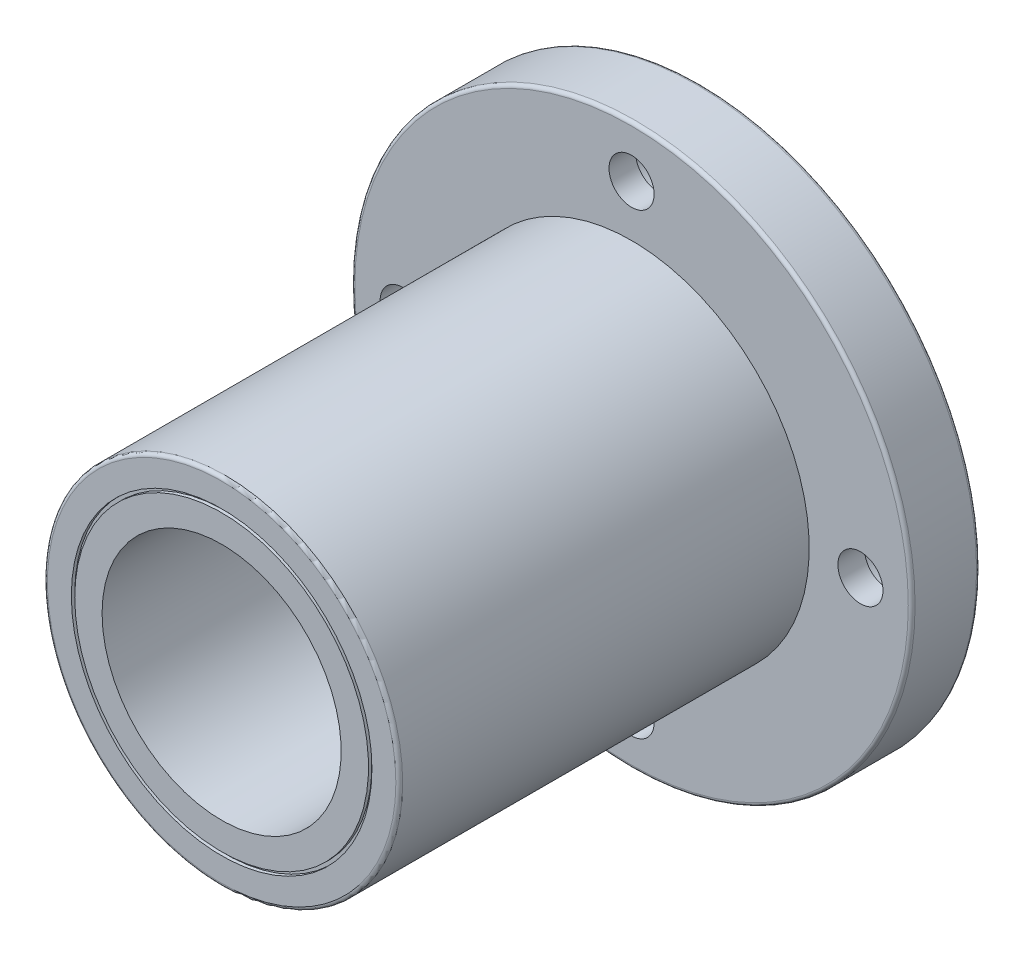
ISO-10303-21;
HEADER;
FILE_DESCRIPTION(('STEP AP214'),'2;1');
FILE_NAME('part.step','',(''),(''),'','','');
FILE_SCHEMA(('AUTOMOTIVE_DESIGN { 1 0 10303 214 1 1 1 1 }'));
ENDSEC;
DATA;
#1=APPLICATION_CONTEXT('core data for automotive mechanical design processes');
#2=APPLICATION_PROTOCOL_DEFINITION('international standard','automotive_design',2000,#1);
#3=PRODUCT_CONTEXT('',#1,'mechanical');
#4=PRODUCT('Part','Part','',(#3));
#5=PRODUCT_RELATED_PRODUCT_CATEGORY('part','',(#4));
#6=PRODUCT_DEFINITION_FORMATION('','',#4);
#7=PRODUCT_DEFINITION_CONTEXT('part definition',#1,'design');
#8=PRODUCT_DEFINITION('design','',#6,#7);
#9=PRODUCT_DEFINITION_SHAPE('','',#8);
#10=(LENGTH_UNIT() NAMED_UNIT(*) SI_UNIT(.MILLI.,.METRE.));
#11=(NAMED_UNIT(*) PLANE_ANGLE_UNIT() SI_UNIT($,.RADIAN.));
#12=(NAMED_UNIT(*) SI_UNIT($,.STERADIAN.) SOLID_ANGLE_UNIT());
#13=UNCERTAINTY_MEASURE_WITH_UNIT(LENGTH_MEASURE(1.E-05),#10,'distance_accuracy_value','');
#14=(GEOMETRIC_REPRESENTATION_CONTEXT(3) GLOBAL_UNCERTAINTY_ASSIGNED_CONTEXT((#13)) GLOBAL_UNIT_ASSIGNED_CONTEXT((#10,
#11,#12)) REPRESENTATION_CONTEXT('',''));
#15=CARTESIAN_POINT('',(0.,0.,0.));
#16=DIRECTION('',(0.,0.,1.));
#17=DIRECTION('',(1.,0.,0.));
#18=AXIS2_PLACEMENT_3D('',#15,#16,#17);
#19=CARTESIAN_POINT('',(0.,26.,0.));
#20=DIRECTION('',(0.,0.,-1.));
#21=DIRECTION('',(-1.,0.,0.));
#22=AXIS2_PLACEMENT_3D('',#19,#20,#21);
#23=PLANE('',#22);
#24=CARTESIAN_POINT('',(0.,0.,0.));
#25=DIRECTION('',(0.,0.,-1.));
#26=DIRECTION('',(-1.,0.,0.));
#27=AXIS2_PLACEMENT_3D('',#24,#25,#26);
#28=CIRCLE('',#27,40.5);
#29=CARTESIAN_POINT('',(-40.5,0.,0.));
#30=VERTEX_POINT('',#29);
#31=EDGE_CURVE('E72',#30,#30,#28,.T.);
#32=ORIENTED_EDGE('',*,*,#31,.T.);
#33=EDGE_LOOP('',(#32));
#34=FACE_BOUND('',#33,.T.);
#35=CARTESIAN_POINT('',(0.,-33.5,0.));
#36=DIRECTION('',(0.,0.,1.));
#37=DIRECTION('',(0.,1.,0.));
#38=AXIS2_PLACEMENT_3D('',#35,#36,#37);
#39=CIRCLE('',#38,5.49999999999999);
#40=CARTESIAN_POINT('',(0.,-28.,0.));
#41=VERTEX_POINT('',#40);
#42=EDGE_CURVE('E166',#41,#41,#39,.T.);
#43=ORIENTED_EDGE('',*,*,#42,.T.);
#44=EDGE_LOOP('',(#43));
#45=FACE_BOUND('',#44,.T.);
#46=CARTESIAN_POINT('',(0.,33.5,0.));
#47=DIRECTION('',(0.,0.,1.));
#48=DIRECTION('',(0.,-1.,0.));
#49=AXIS2_PLACEMENT_3D('',#46,#47,#48);
#50=CIRCLE('',#49,5.49999999999999);
#51=CARTESIAN_POINT('',(0.,28.,0.));
#52=VERTEX_POINT('',#51);
#53=EDGE_CURVE('E135',#52,#52,#50,.T.);
#54=ORIENTED_EDGE('',*,*,#53,.T.);
#55=EDGE_LOOP('',(#54));
#56=FACE_BOUND('',#55,.T.);
#57=CARTESIAN_POINT('',(0.,0.,0.));
#58=DIRECTION('',(0.,0.,-1.));
#59=DIRECTION('',(-1.,0.,0.));
#60=AXIS2_PLACEMENT_3D('',#57,#58,#59);
#61=CIRCLE('',#60,26.);
#62=CARTESIAN_POINT('',(-26.,0.,0.));
#63=VERTEX_POINT('',#62);
#64=EDGE_CURVE('E131',#63,#63,#61,.T.);
#65=ORIENTED_EDGE('',*,*,#64,.F.);
#66=EDGE_LOOP('',(#65));
#67=FACE_BOUND('',#66,.T.);
#68=CARTESIAN_POINT('',(33.5,-1.16964624851245E-13,0.));
#69=DIRECTION('',(0.,0.,1.));
#70=DIRECTION('',(-1.,0.,0.));
#71=AXIS2_PLACEMENT_3D('',#68,#69,#70);
#72=CIRCLE('',#71,5.49999999999999);
#73=CARTESIAN_POINT('',(28.,0.,0.));
#74=VERTEX_POINT('',#73);
#75=EDGE_CURVE('E151',#74,#74,#72,.T.);
#76=ORIENTED_EDGE('',*,*,#75,.T.);
#77=EDGE_LOOP('',(#76));
#78=FACE_BOUND('',#77,.T.);
#79=CARTESIAN_POINT('',(-33.5,3.50893874553735E-13,0.));
#80=DIRECTION('',(0.,0.,1.));
#81=DIRECTION('',(1.,0.,0.));
#82=AXIS2_PLACEMENT_3D('',#79,#80,#81);
#83=CIRCLE('',#82,5.49999999999999);
#84=CARTESIAN_POINT('',(-28.,2.93284432462823E-13,0.));
#85=VERTEX_POINT('',#84);
#86=EDGE_CURVE('E181',#85,#85,#83,.T.);
#87=ORIENTED_EDGE('',*,*,#86,.T.);
#88=EDGE_LOOP('',(#87));
#89=FACE_BOUND('',#88,.T.);
#90=ADVANCED_FACE('F40',(#34,#45,#56,#67,#78,#89),#23,.T.);
#91=CARTESIAN_POINT('',(0.,41.,10.));
#92=DIRECTION('',(0.,0.,1.));
#93=DIRECTION('',(1.,0.,0.));
#94=AXIS2_PLACEMENT_3D('',#91,#92,#93);
#95=PLANE('',#94);
#96=CARTESIAN_POINT('',(0.,0.,10.));
#97=DIRECTION('',(0.,0.,1.));
#98=DIRECTION('',(1.,0.,0.));
#99=AXIS2_PLACEMENT_3D('',#96,#97,#98);
#100=CIRCLE('',#99,40.5);
#101=CARTESIAN_POINT('',(40.5,0.,10.));
#102=VERTEX_POINT('',#101);
#103=EDGE_CURVE('E55',#102,#102,#100,.T.);
#104=ORIENTED_EDGE('',*,*,#103,.T.);
#105=EDGE_LOOP('',(#104));
#106=FACE_BOUND('',#105,.T.);
#107=CARTESIAN_POINT('',(0.,-33.5,10.));
#108=DIRECTION('',(0.,0.,1.));
#109=DIRECTION('',(0.,1.,0.));
#110=AXIS2_PLACEMENT_3D('',#107,#108,#109);
#111=CIRCLE('',#110,3.29999999999996);
#112=CARTESIAN_POINT('',(0.,-30.2000000000001,10.));
#113=VERTEX_POINT('',#112);
#114=EDGE_CURVE('E178',#113,#113,#111,.T.);
#115=ORIENTED_EDGE('',*,*,#114,.F.);
#116=EDGE_LOOP('',(#115));
#117=FACE_BOUND('',#116,.T.);
#118=CARTESIAN_POINT('',(0.,33.5,10.));
#119=DIRECTION('',(0.,0.,1.));
#120=DIRECTION('',(0.,-1.,0.));
#121=AXIS2_PLACEMENT_3D('',#118,#119,#120);
#122=CIRCLE('',#121,3.29999999999996);
#123=CARTESIAN_POINT('',(0.,30.2000000000001,10.));
#124=VERTEX_POINT('',#123);
#125=EDGE_CURVE('E147',#124,#124,#122,.T.);
#126=ORIENTED_EDGE('',*,*,#125,.F.);
#127=EDGE_LOOP('',(#126));
#128=FACE_BOUND('',#127,.T.);
#129=CARTESIAN_POINT('',(0.,0.,10.));
#130=DIRECTION('',(0.,0.,-1.));
#131=DIRECTION('',(-1.,0.,0.));
#132=AXIS2_PLACEMENT_3D('',#129,#130,#131);
#133=CIRCLE('',#132,26.);
#134=CARTESIAN_POINT('',(-26.,0.,10.));
#135=VERTEX_POINT('',#134);
#136=EDGE_CURVE('E76',#135,#135,#133,.T.);
#137=ORIENTED_EDGE('',*,*,#136,.T.);
#138=EDGE_LOOP('',(#137));
#139=FACE_BOUND('',#138,.T.);
#140=CARTESIAN_POINT('',(33.5,-1.16964624851245E-13,10.));
#141=DIRECTION('',(0.,0.,1.));
#142=DIRECTION('',(-1.,0.,0.));
#143=AXIS2_PLACEMENT_3D('',#140,#141,#142);
#144=CIRCLE('',#143,3.29999999999996);
#145=CARTESIAN_POINT('',(30.2000000000001,-1.05442736433063E-13,10.));
#146=VERTEX_POINT('',#145);
#147=EDGE_CURVE('E162',#146,#146,#144,.T.);
#148=ORIENTED_EDGE('',*,*,#147,.F.);
#149=EDGE_LOOP('',(#148));
#150=FACE_BOUND('',#149,.T.);
#151=CARTESIAN_POINT('',(-33.5,3.50893874553735E-13,10.));
#152=DIRECTION('',(0.,0.,1.));
#153=DIRECTION('',(1.,0.,0.));
#154=AXIS2_PLACEMENT_3D('',#151,#152,#153);
#155=CIRCLE('',#154,3.29999999999996);
#156=CARTESIAN_POINT('',(-30.2000000000001,3.16328209299189E-13,10.));
#157=VERTEX_POINT('',#156);
#158=EDGE_CURVE('E192',#157,#157,#155,.T.);
#159=ORIENTED_EDGE('',*,*,#158,.F.);
#160=EDGE_LOOP('',(#159));
#161=FACE_BOUND('',#160,.T.);
#162=ADVANCED_FACE('F200',(#106,#117,#128,#139,#150,#161),#95,.T.);
#163=CARTESIAN_POINT('',(0.,0.,0.));
#164=DIRECTION('',(0.,0.,-1.));
#165=DIRECTION('',(-1.,0.,0.));
#166=AXIS2_PLACEMENT_3D('',#163,#164,#165);
#167=CYLINDRICAL_SURFACE('',#166,41.);
#168=CARTESIAN_POINT('',(0.,0.,0.5));
#169=DIRECTION('',(0.,0.,-1.));
#170=DIRECTION('',(-1.,0.,0.));
#171=AXIS2_PLACEMENT_3D('',#168,#169,#170);
#172=CIRCLE('',#171,41.);
#173=CARTESIAN_POINT('',(-41.,0.,0.5));
#174=VERTEX_POINT('',#173);
#175=EDGE_CURVE('E62',#174,#174,#172,.F.);
#176=ORIENTED_EDGE('',*,*,#175,.T.);
#177=EDGE_LOOP('',(#176));
#178=FACE_BOUND('',#177,.T.);
#179=CARTESIAN_POINT('',(0.,0.,9.5));
#180=DIRECTION('',(0.,0.,1.));
#181=DIRECTION('',(1.,0.,0.));
#182=AXIS2_PLACEMENT_3D('',#179,#180,#181);
#183=CIRCLE('',#182,41.);
#184=CARTESIAN_POINT('',(41.,0.,9.5));
#185=VERTEX_POINT('',#184);
#186=EDGE_CURVE('E68',#185,#185,#183,.F.);
#187=ORIENTED_EDGE('',*,*,#186,.T.);
#188=EDGE_LOOP('',(#187));
#189=FACE_BOUND('',#188,.T.);
#190=ADVANCED_FACE('F202',(#178,#189),#167,.T.);
#191=CARTESIAN_POINT('',(0.,0.,0.));
#192=DIRECTION('',(0.,0.,-1.));
#193=DIRECTION('',(-1.,0.,0.));
#194=AXIS2_PLACEMENT_3D('',#191,#192,#193);
#195=CYLINDRICAL_SURFACE('',#194,26.);
#196=CARTESIAN_POINT('',(0.,0.,69.5));
#197=DIRECTION('',(0.,0.,1.));
#198=DIRECTION('',(1.,0.,0.));
#199=AXIS2_PLACEMENT_3D('',#196,#197,#198);
#200=CIRCLE('',#199,26.);
#201=CARTESIAN_POINT('',(26.,0.,69.5));
#202=VERTEX_POINT('',#201);
#203=EDGE_CURVE('E48',#202,#202,#200,.F.);
#204=ORIENTED_EDGE('',*,*,#203,.T.);
#205=EDGE_LOOP('',(#204));
#206=FACE_BOUND('',#205,.T.);
#207=ORIENTED_EDGE('',*,*,#136,.F.);
#208=EDGE_LOOP('',(#207));
#209=FACE_BOUND('',#208,.T.);
#210=ADVANCED_FACE('F209',(#206,#209),#195,.T.);
#211=CARTESIAN_POINT('',(0.,26.,70.));
#212=DIRECTION('',(0.,0.,1.));
#213=DIRECTION('',(1.,0.,0.));
#214=AXIS2_PLACEMENT_3D('',#211,#212,#213);
#215=PLANE('',#214);
#216=CARTESIAN_POINT('',(0.,0.,70.));
#217=DIRECTION('',(0.,0.,1.));
#218=DIRECTION('',(1.,0.,0.));
#219=AXIS2_PLACEMENT_3D('',#216,#217,#218);
#220=CIRCLE('',#219,25.5);
#221=CARTESIAN_POINT('',(25.5,0.,70.));
#222=VERTEX_POINT('',#221);
#223=EDGE_CURVE('E10',#222,#222,#220,.T.);
#224=ORIENTED_EDGE('',*,*,#223,.T.);
#225=EDGE_LOOP('',(#224));
#226=FACE_BOUND('',#225,.T.);
#227=CARTESIAN_POINT('',(0.,0.,70.));
#228=DIRECTION('',(0.,0.,-1.));
#229=DIRECTION('',(-1.,0.,0.));
#230=AXIS2_PLACEMENT_3D('',#227,#228,#229);
#231=CIRCLE('',#230,22.);
#232=CARTESIAN_POINT('',(-22.,0.,70.));
#233=VERTEX_POINT('',#232);
#234=EDGE_CURVE('E80',#233,#233,#231,.T.);
#235=ORIENTED_EDGE('',*,*,#234,.T.);
#236=EDGE_LOOP('',(#235));
#237=FACE_BOUND('',#236,.T.);
#238=ADVANCED_FACE('F466',(#226,#237),#215,.T.);
#239=CARTESIAN_POINT('',(0.,0.,0.));
#240=DIRECTION('',(0.,0.,-1.));
#241=DIRECTION('',(-1.,0.,0.));
#242=AXIS2_PLACEMENT_3D('',#239,#240,#241);
#243=CYLINDRICAL_SURFACE('',#242,22.);
#244=CARTESIAN_POINT('',(0.,0.,69.5));
#245=DIRECTION('',(0.,0.,-1.));
#246=DIRECTION('',(-1.,0.,0.));
#247=AXIS2_PLACEMENT_3D('',#244,#245,#246);
#248=CIRCLE('',#247,22.);
#249=CARTESIAN_POINT('',(-22.,0.,69.5));
#250=VERTEX_POINT('',#249);
#251=EDGE_CURVE('E84',#250,#250,#248,.T.);
#252=ORIENTED_EDGE('',*,*,#251,.T.);
#253=EDGE_LOOP('',(#252));
#254=FACE_BOUND('',#253,.T.);
#255=ORIENTED_EDGE('',*,*,#234,.F.);
#256=EDGE_LOOP('',(#255));
#257=FACE_BOUND('',#256,.T.);
#258=ADVANCED_FACE('F457',(#254,#257),#243,.F.);
#259=CARTESIAN_POINT('',(0.,22.,69.5));
#260=DIRECTION('',(0.,0.,1.));
#261=DIRECTION('',(1.,0.,0.));
#262=AXIS2_PLACEMENT_3D('',#259,#260,#261);
#263=PLANE('',#262);
#264=CARTESIAN_POINT('',(0.,0.,69.5));
#265=DIRECTION('',(0.,0.,-1.));
#266=DIRECTION('',(-1.,0.,0.));
#267=AXIS2_PLACEMENT_3D('',#264,#265,#266);
#268=CIRCLE('',#267,21.5);
#269=CARTESIAN_POINT('',(-21.5,0.,69.5));
#270=VERTEX_POINT('',#269);
#271=EDGE_CURVE('E88',#270,#270,#268,.T.);
#272=ORIENTED_EDGE('',*,*,#271,.T.);
#273=EDGE_LOOP('',(#272));
#274=FACE_BOUND('',#273,.T.);
#275=ORIENTED_EDGE('',*,*,#251,.F.);
#276=EDGE_LOOP('',(#275));
#277=FACE_BOUND('',#276,.T.);
#278=ADVANCED_FACE('F448',(#274,#277),#263,.T.);
#279=CARTESIAN_POINT('',(0.,0.,0.));
#280=DIRECTION('',(0.,0.,-1.));
#281=DIRECTION('',(-1.,0.,0.));
#282=AXIS2_PLACEMENT_3D('',#279,#280,#281);
#283=CYLINDRICAL_SURFACE('',#282,21.5);
#284=CARTESIAN_POINT('',(0.,0.,70.));
#285=DIRECTION('',(0.,0.,-1.));
#286=DIRECTION('',(-1.,0.,0.));
#287=AXIS2_PLACEMENT_3D('',#284,#285,#286);
#288=CIRCLE('',#287,21.5);
#289=CARTESIAN_POINT('',(-21.5,0.,70.));
#290=VERTEX_POINT('',#289);
#291=EDGE_CURVE('E92',#290,#290,#288,.T.);
#292=ORIENTED_EDGE('',*,*,#291,.T.);
#293=EDGE_LOOP('',(#292));
#294=FACE_BOUND('',#293,.T.);
#295=ORIENTED_EDGE('',*,*,#271,.F.);
#296=EDGE_LOOP('',(#295));
#297=FACE_BOUND('',#296,.T.);
#298=ADVANCED_FACE('F440',(#294,#297),#283,.T.);
#299=CARTESIAN_POINT('',(0.,21.5,70.));
#300=DIRECTION('',(0.,0.,1.));
#301=DIRECTION('',(1.,0.,0.));
#302=AXIS2_PLACEMENT_3D('',#299,#300,#301);
#303=PLANE('',#302);
#304=CARTESIAN_POINT('',(0.,0.,70.));
#305=DIRECTION('',(0.,0.,-1.));
#306=DIRECTION('',(-1.,0.,0.));
#307=AXIS2_PLACEMENT_3D('',#304,#305,#306);
#308=CIRCLE('',#307,17.5);
#309=CARTESIAN_POINT('',(-17.5,0.,70.));
#310=VERTEX_POINT('',#309);
#311=EDGE_CURVE('E95',#310,#310,#308,.T.);
#312=ORIENTED_EDGE('',*,*,#311,.T.);
#313=EDGE_LOOP('',(#312));
#314=FACE_BOUND('',#313,.T.);
#315=ORIENTED_EDGE('',*,*,#291,.F.);
#316=EDGE_LOOP('',(#315));
#317=FACE_BOUND('',#316,.T.);
#318=ADVANCED_FACE('F432',(#314,#317),#303,.T.);
#319=CARTESIAN_POINT('',(0.,0.,0.));
#320=DIRECTION('',(0.,0.,-1.));
#321=DIRECTION('',(-1.,0.,0.));
#322=AXIS2_PLACEMENT_3D('',#319,#320,#321);
#323=CYLINDRICAL_SURFACE('',#322,17.5);
#324=CARTESIAN_POINT('',(0.,0.,0.));
#325=DIRECTION('',(0.,0.,-1.));
#326=DIRECTION('',(-1.,0.,0.));
#327=AXIS2_PLACEMENT_3D('',#324,#325,#326);
#328=CIRCLE('',#327,17.5);
#329=CARTESIAN_POINT('',(-17.5,0.,0.));
#330=VERTEX_POINT('',#329);
#331=EDGE_CURVE('E99',#330,#330,#328,.T.);
#332=ORIENTED_EDGE('',*,*,#331,.T.);
#333=EDGE_LOOP('',(#332));
#334=FACE_BOUND('',#333,.T.);
#335=ORIENTED_EDGE('',*,*,#311,.F.);
#336=EDGE_LOOP('',(#335));
#337=FACE_BOUND('',#336,.T.);
#338=ADVANCED_FACE('F423',(#334,#337),#323,.F.);
#339=CARTESIAN_POINT('',(0.,17.5,0.));
#340=DIRECTION('',(0.,0.,-1.));
#341=DIRECTION('',(-1.,0.,0.));
#342=AXIS2_PLACEMENT_3D('',#339,#340,#341);
#343=PLANE('',#342);
#344=CARTESIAN_POINT('',(0.,0.,0.));
#345=DIRECTION('',(0.,0.,-1.));
#346=DIRECTION('',(-1.,0.,0.));
#347=AXIS2_PLACEMENT_3D('',#344,#345,#346);
#348=CIRCLE('',#347,21.5);
#349=CARTESIAN_POINT('',(-21.5,0.,0.));
#350=VERTEX_POINT('',#349);
#351=EDGE_CURVE('E103',#350,#350,#348,.T.);
#352=ORIENTED_EDGE('',*,*,#351,.T.);
#353=EDGE_LOOP('',(#352));
#354=FACE_BOUND('',#353,.T.);
#355=ORIENTED_EDGE('',*,*,#331,.F.);
#356=EDGE_LOOP('',(#355));
#357=FACE_BOUND('',#356,.T.);
#358=ADVANCED_FACE('F414',(#354,#357),#343,.T.);
#359=CARTESIAN_POINT('',(0.,0.,0.));
#360=DIRECTION('',(0.,0.,-1.));
#361=DIRECTION('',(-1.,0.,0.));
#362=AXIS2_PLACEMENT_3D('',#359,#360,#361);
#363=CYLINDRICAL_SURFACE('',#362,21.5);
#364=CARTESIAN_POINT('',(0.,0.,0.5));
#365=DIRECTION('',(0.,0.,-1.));
#366=DIRECTION('',(-1.,0.,0.));
#367=AXIS2_PLACEMENT_3D('',#364,#365,#366);
#368=CIRCLE('',#367,21.5);
#369=CARTESIAN_POINT('',(-21.5,0.,0.5));
#370=VERTEX_POINT('',#369);
#371=EDGE_CURVE('E107',#370,#370,#368,.T.);
#372=ORIENTED_EDGE('',*,*,#371,.T.);
#373=EDGE_LOOP('',(#372));
#374=FACE_BOUND('',#373,.T.);
#375=ORIENTED_EDGE('',*,*,#351,.F.);
#376=EDGE_LOOP('',(#375));
#377=FACE_BOUND('',#376,.T.);
#378=ADVANCED_FACE('F405',(#374,#377),#363,.T.);
#379=CARTESIAN_POINT('',(0.,22.,0.5));
#380=DIRECTION('',(0.,0.,-1.));
#381=DIRECTION('',(-1.,0.,0.));
#382=AXIS2_PLACEMENT_3D('',#379,#380,#381);
#383=PLANE('',#382);
#384=CARTESIAN_POINT('',(0.,0.,0.5));
#385=DIRECTION('',(0.,0.,-1.));
#386=DIRECTION('',(-1.,0.,0.));
#387=AXIS2_PLACEMENT_3D('',#384,#385,#386);
#388=CIRCLE('',#387,22.);
#389=CARTESIAN_POINT('',(-22.,0.,0.5));
#390=VERTEX_POINT('',#389);
#391=EDGE_CURVE('E111',#390,#390,#388,.T.);
#392=ORIENTED_EDGE('',*,*,#391,.T.);
#393=EDGE_LOOP('',(#392));
#394=FACE_BOUND('',#393,.T.);
#395=ORIENTED_EDGE('',*,*,#371,.F.);
#396=EDGE_LOOP('',(#395));
#397=FACE_BOUND('',#396,.T.);
#398=ADVANCED_FACE('F396',(#394,#397),#383,.T.);
#399=CARTESIAN_POINT('',(0.,0.,0.));
#400=DIRECTION('',(0.,0.,-1.));
#401=DIRECTION('',(-1.,0.,0.));
#402=AXIS2_PLACEMENT_3D('',#399,#400,#401);
#403=CYLINDRICAL_SURFACE('',#402,22.);
#404=CARTESIAN_POINT('',(0.,0.,0.));
#405=DIRECTION('',(0.,0.,-1.));
#406=DIRECTION('',(-1.,0.,0.));
#407=AXIS2_PLACEMENT_3D('',#404,#405,#406);
#408=CIRCLE('',#407,22.);
#409=CARTESIAN_POINT('',(-22.,0.,0.));
#410=VERTEX_POINT('',#409);
#411=EDGE_CURVE('E115',#410,#410,#408,.T.);
#412=ORIENTED_EDGE('',*,*,#411,.T.);
#413=EDGE_LOOP('',(#412));
#414=FACE_BOUND('',#413,.T.);
#415=ORIENTED_EDGE('',*,*,#391,.F.);
#416=EDGE_LOOP('',(#415));
#417=FACE_BOUND('',#416,.T.);
#418=ADVANCED_FACE('F387',(#414,#417),#403,.F.);
#419=CARTESIAN_POINT('',(0.,22.,0.));
#420=DIRECTION('',(0.,0.,-1.));
#421=DIRECTION('',(-1.,0.,0.));
#422=AXIS2_PLACEMENT_3D('',#419,#420,#421);
#423=PLANE('',#422);
#424=CARTESIAN_POINT('',(0.,0.,0.));
#425=DIRECTION('',(0.,0.,-1.));
#426=DIRECTION('',(-1.,0.,0.));
#427=AXIS2_PLACEMENT_3D('',#424,#425,#426);
#428=CIRCLE('',#427,25.5);
#429=CARTESIAN_POINT('',(-25.5,0.,0.));
#430=VERTEX_POINT('',#429);
#431=EDGE_CURVE('E119',#430,#430,#428,.T.);
#432=ORIENTED_EDGE('',*,*,#431,.T.);
#433=EDGE_LOOP('',(#432));
#434=FACE_BOUND('',#433,.T.);
#435=ORIENTED_EDGE('',*,*,#411,.F.);
#436=EDGE_LOOP('',(#435));
#437=FACE_BOUND('',#436,.T.);
#438=ADVANCED_FACE('F378',(#434,#437),#423,.T.);
#439=CARTESIAN_POINT('',(0.,0.,0.));
#440=DIRECTION('',(0.,0.,-1.));
#441=DIRECTION('',(-1.,0.,0.));
#442=AXIS2_PLACEMENT_3D('',#439,#440,#441);
#443=CYLINDRICAL_SURFACE('',#442,25.5);
#444=CARTESIAN_POINT('',(0.,0.,0.5));
#445=DIRECTION('',(0.,0.,-1.));
#446=DIRECTION('',(-1.,0.,0.));
#447=AXIS2_PLACEMENT_3D('',#444,#445,#446);
#448=CIRCLE('',#447,25.5);
#449=CARTESIAN_POINT('',(-25.5,0.,0.5));
#450=VERTEX_POINT('',#449);
#451=EDGE_CURVE('E123',#450,#450,#448,.T.);
#452=ORIENTED_EDGE('',*,*,#451,.T.);
#453=EDGE_LOOP('',(#452));
#454=FACE_BOUND('',#453,.T.);
#455=ORIENTED_EDGE('',*,*,#431,.F.);
#456=EDGE_LOOP('',(#455));
#457=FACE_BOUND('',#456,.T.);
#458=ADVANCED_FACE('F369',(#454,#457),#443,.T.);
#459=CARTESIAN_POINT('',(0.,26.,0.5));
#460=DIRECTION('',(0.,0.,-1.));
#461=DIRECTION('',(-1.,0.,0.));
#462=AXIS2_PLACEMENT_3D('',#459,#460,#461);
#463=PLANE('',#462);
#464=CARTESIAN_POINT('',(0.,0.,0.5));
#465=DIRECTION('',(0.,0.,-1.));
#466=DIRECTION('',(-1.,0.,0.));
#467=AXIS2_PLACEMENT_3D('',#464,#465,#466);
#468=CIRCLE('',#467,26.);
#469=CARTESIAN_POINT('',(-26.,0.,0.5));
#470=VERTEX_POINT('',#469);
#471=EDGE_CURVE('E127',#470,#470,#468,.T.);
#472=ORIENTED_EDGE('',*,*,#471,.T.);
#473=EDGE_LOOP('',(#472));
#474=FACE_BOUND('',#473,.T.);
#475=ORIENTED_EDGE('',*,*,#451,.F.);
#476=EDGE_LOOP('',(#475));
#477=FACE_BOUND('',#476,.T.);
#478=ADVANCED_FACE('F360',(#474,#477),#463,.T.);
#479=CARTESIAN_POINT('',(0.,0.,0.));
#480=DIRECTION('',(0.,0.,-1.));
#481=DIRECTION('',(-1.,0.,0.));
#482=AXIS2_PLACEMENT_3D('',#479,#480,#481);
#483=CYLINDRICAL_SURFACE('',#482,26.);
#484=ORIENTED_EDGE('',*,*,#64,.T.);
#485=EDGE_LOOP('',(#484));
#486=FACE_BOUND('',#485,.T.);
#487=ORIENTED_EDGE('',*,*,#471,.F.);
#488=EDGE_LOOP('',(#487));
#489=FACE_BOUND('',#488,.T.);
#490=ADVANCED_FACE('F351',(#486,#489),#483,.F.);
#491=CARTESIAN_POINT('',(0.,33.5,0.));
#492=DIRECTION('',(0.,0.,1.));
#493=DIRECTION('',(0.,-1.,0.));
#494=AXIS2_PLACEMENT_3D('',#491,#492,#493);
#495=CYLINDRICAL_SURFACE('',#494,5.49999999999998);
#496=CARTESIAN_POINT('',(0.,33.5,6.10000000000002));
#497=DIRECTION('',(0.,0.,1.));
#498=DIRECTION('',(0.,-1.,0.));
#499=AXIS2_PLACEMENT_3D('',#496,#497,#498);
#500=CIRCLE('',#499,5.49999999999998);
#501=CARTESIAN_POINT('',(0.,28.0000000000001,6.10000000000003));
#502=VERTEX_POINT('',#501);
#503=EDGE_CURVE('E139',#502,#502,#500,.T.);
#504=ORIENTED_EDGE('',*,*,#503,.T.);
#505=EDGE_LOOP('',(#504));
#506=FACE_BOUND('',#505,.T.);
#507=ORIENTED_EDGE('',*,*,#53,.F.);
#508=EDGE_LOOP('',(#507));
#509=FACE_BOUND('',#508,.T.);
#510=ADVANCED_FACE('F342',(#506,#509),#495,.F.);
#511=CARTESIAN_POINT('',(0.,39.,6.1));
#512=DIRECTION('',(0.,0.,-1.));
#513=DIRECTION('',(0.,1.,0.));
#514=AXIS2_PLACEMENT_3D('',#511,#512,#513);
#515=PLANE('',#514);
#516=CARTESIAN_POINT('',(0.,33.5,6.10000000000001));
#517=DIRECTION('',(0.,0.,1.));
#518=DIRECTION('',(0.,-1.,0.));
#519=AXIS2_PLACEMENT_3D('',#516,#517,#518);
#520=CIRCLE('',#519,3.29999999999997);
#521=CARTESIAN_POINT('',(0.,30.2000000000001,6.10000000000002));
#522=VERTEX_POINT('',#521);
#523=EDGE_CURVE('E143',#522,#522,#520,.T.);
#524=ORIENTED_EDGE('',*,*,#523,.T.);
#525=EDGE_LOOP('',(#524));
#526=FACE_BOUND('',#525,.T.);
#527=ORIENTED_EDGE('',*,*,#503,.F.);
#528=EDGE_LOOP('',(#527));
#529=FACE_BOUND('',#528,.T.);
#530=ADVANCED_FACE('F333',(#526,#529),#515,.T.);
#531=CARTESIAN_POINT('',(0.,33.5,0.));
#532=DIRECTION('',(0.,0.,1.));
#533=DIRECTION('',(0.,-1.,0.));
#534=AXIS2_PLACEMENT_3D('',#531,#532,#533);
#535=CYLINDRICAL_SURFACE('',#534,3.29999999999997);
#536=ORIENTED_EDGE('',*,*,#125,.T.);
#537=EDGE_LOOP('',(#536));
#538=FACE_BOUND('',#537,.T.);
#539=ORIENTED_EDGE('',*,*,#523,.F.);
#540=EDGE_LOOP('',(#539));
#541=FACE_BOUND('',#540,.T.);
#542=ADVANCED_FACE('F324',(#538,#541),#535,.F.);
#543=CARTESIAN_POINT('',(33.5,-1.16964624851245E-13,0.));
#544=DIRECTION('',(0.,0.,1.));
#545=DIRECTION('',(-1.,0.,0.));
#546=AXIS2_PLACEMENT_3D('',#543,#544,#545);
#547=CYLINDRICAL_SURFACE('',#546,5.49999999999998);
#548=CARTESIAN_POINT('',(33.5,-1.16964624851245E-13,6.10000000000002));
#549=DIRECTION('',(0.,0.,1.));
#550=DIRECTION('',(-1.,0.,0.));
#551=AXIS2_PLACEMENT_3D('',#548,#549,#550);
#552=CIRCLE('',#551,5.49999999999998);
#553=CARTESIAN_POINT('',(28.0000000000001,0.,6.10000000000003));
#554=VERTEX_POINT('',#553);
#555=EDGE_CURVE('E154',#554,#554,#552,.T.);
#556=ORIENTED_EDGE('',*,*,#555,.T.);
#557=EDGE_LOOP('',(#556));
#558=FACE_BOUND('',#557,.T.);
#559=ORIENTED_EDGE('',*,*,#75,.F.);
#560=EDGE_LOOP('',(#559));
#561=FACE_BOUND('',#560,.T.);
#562=ADVANCED_FACE('F315',(#558,#561),#547,.F.);
#563=CARTESIAN_POINT('',(39.,-1.36167772214882E-13,6.1));
#564=DIRECTION('',(0.,0.,-1.));
#565=DIRECTION('',(1.,0.,0.));
#566=AXIS2_PLACEMENT_3D('',#563,#564,#565);
#567=PLANE('',#566);
#568=CARTESIAN_POINT('',(33.5,-1.16964624851245E-13,6.10000000000001));
#569=DIRECTION('',(0.,0.,1.));
#570=DIRECTION('',(-1.,0.,0.));
#571=AXIS2_PLACEMENT_3D('',#568,#569,#570);
#572=CIRCLE('',#571,3.29999999999997);
#573=CARTESIAN_POINT('',(30.2000000000001,-1.05442736433063E-13,6.10000000000002));
#574=VERTEX_POINT('',#573);
#575=EDGE_CURVE('E158',#574,#574,#572,.T.);
#576=ORIENTED_EDGE('',*,*,#575,.T.);
#577=EDGE_LOOP('',(#576));
#578=FACE_BOUND('',#577,.T.);
#579=ORIENTED_EDGE('',*,*,#555,.F.);
#580=EDGE_LOOP('',(#579));
#581=FACE_BOUND('',#580,.T.);
#582=ADVANCED_FACE('F306',(#578,#581),#567,.T.);
#583=CARTESIAN_POINT('',(33.5,-1.16964624851245E-13,0.));
#584=DIRECTION('',(0.,0.,1.));
#585=DIRECTION('',(-1.,0.,0.));
#586=AXIS2_PLACEMENT_3D('',#583,#584,#585);
#587=CYLINDRICAL_SURFACE('',#586,3.29999999999997);
#588=ORIENTED_EDGE('',*,*,#147,.T.);
#589=EDGE_LOOP('',(#588));
#590=FACE_BOUND('',#589,.T.);
#591=ORIENTED_EDGE('',*,*,#575,.F.);
#592=EDGE_LOOP('',(#591));
#593=FACE_BOUND('',#592,.T.);
#594=ADVANCED_FACE('F298',(#590,#593),#587,.F.);
#595=CARTESIAN_POINT('',(0.,-33.5,0.));
#596=DIRECTION('',(0.,0.,1.));
#597=DIRECTION('',(0.,1.,0.));
#598=AXIS2_PLACEMENT_3D('',#595,#596,#597);
#599=CYLINDRICAL_SURFACE('',#598,5.49999999999998);
#600=CARTESIAN_POINT('',(0.,-33.5,6.10000000000002));
#601=DIRECTION('',(0.,0.,1.));
#602=DIRECTION('',(0.,1.,0.));
#603=AXIS2_PLACEMENT_3D('',#600,#601,#602);
#604=CIRCLE('',#603,5.49999999999998);
#605=CARTESIAN_POINT('',(0.,-28.0000000000001,6.10000000000003));
#606=VERTEX_POINT('',#605);
#607=EDGE_CURVE('E170',#606,#606,#604,.T.);
#608=ORIENTED_EDGE('',*,*,#607,.T.);
#609=EDGE_LOOP('',(#608));
#610=FACE_BOUND('',#609,.T.);
#611=ORIENTED_EDGE('',*,*,#42,.F.);
#612=EDGE_LOOP('',(#611));
#613=FACE_BOUND('',#612,.T.);
#614=ADVANCED_FACE('F289',(#610,#613),#599,.F.);
#615=CARTESIAN_POINT('',(0.,-39.,6.1));
#616=DIRECTION('',(0.,0.,-1.));
#617=DIRECTION('',(0.,-1.,0.));
#618=AXIS2_PLACEMENT_3D('',#615,#616,#617);
#619=PLANE('',#618);
#620=CARTESIAN_POINT('',(0.,-33.5,6.10000000000001));
#621=DIRECTION('',(0.,0.,1.));
#622=DIRECTION('',(0.,1.,0.));
#623=AXIS2_PLACEMENT_3D('',#620,#621,#622);
#624=CIRCLE('',#623,3.29999999999997);
#625=CARTESIAN_POINT('',(0.,-30.2000000000001,6.10000000000002));
#626=VERTEX_POINT('',#625);
#627=EDGE_CURVE('E174',#626,#626,#624,.T.);
#628=ORIENTED_EDGE('',*,*,#627,.T.);
#629=EDGE_LOOP('',(#628));
#630=FACE_BOUND('',#629,.T.);
#631=ORIENTED_EDGE('',*,*,#607,.F.);
#632=EDGE_LOOP('',(#631));
#633=FACE_BOUND('',#632,.T.);
#634=ADVANCED_FACE('F280',(#630,#633),#619,.T.);
#635=CARTESIAN_POINT('',(0.,-33.5,0.));
#636=DIRECTION('',(0.,0.,1.));
#637=DIRECTION('',(0.,1.,0.));
#638=AXIS2_PLACEMENT_3D('',#635,#636,#637);
#639=CYLINDRICAL_SURFACE('',#638,3.29999999999997);
#640=ORIENTED_EDGE('',*,*,#114,.T.);
#641=EDGE_LOOP('',(#640));
#642=FACE_BOUND('',#641,.T.);
#643=ORIENTED_EDGE('',*,*,#627,.F.);
#644=EDGE_LOOP('',(#643));
#645=FACE_BOUND('',#644,.T.);
#646=ADVANCED_FACE('F270',(#642,#645),#639,.F.);
#647=CARTESIAN_POINT('',(-33.5,3.50893874553735E-13,0.));
#648=DIRECTION('',(0.,0.,1.));
#649=DIRECTION('',(1.,0.,0.));
#650=AXIS2_PLACEMENT_3D('',#647,#648,#649);
#651=CYLINDRICAL_SURFACE('',#650,5.49999999999998);
#652=CARTESIAN_POINT('',(-33.5,3.50893874553735E-13,6.10000000000002));
#653=DIRECTION('',(0.,0.,1.));
#654=DIRECTION('',(1.,0.,0.));
#655=AXIS2_PLACEMENT_3D('',#652,#653,#654);
#656=CIRCLE('',#655,5.49999999999998);
#657=CARTESIAN_POINT('',(-28.0000000000001,2.93284432462824E-13,6.10000000000003));
#658=VERTEX_POINT('',#657);
#659=EDGE_CURVE('E185',#658,#658,#656,.T.);
#660=ORIENTED_EDGE('',*,*,#659,.T.);
#661=EDGE_LOOP('',(#660));
#662=FACE_BOUND('',#661,.T.);
#663=ORIENTED_EDGE('',*,*,#86,.F.);
#664=EDGE_LOOP('',(#663));
#665=FACE_BOUND('',#664,.T.);
#666=ADVANCED_FACE('F260',(#662,#665),#651,.F.);
#667=CARTESIAN_POINT('',(-39.,4.08503316644647E-13,6.1));
#668=DIRECTION('',(0.,0.,-1.));
#669=DIRECTION('',(-1.,0.,0.));
#670=AXIS2_PLACEMENT_3D('',#667,#668,#669);
#671=PLANE('',#670);
#672=CARTESIAN_POINT('',(-33.5,3.50893874553735E-13,6.10000000000001));
#673=DIRECTION('',(0.,0.,1.));
#674=DIRECTION('',(1.,0.,0.));
#675=AXIS2_PLACEMENT_3D('',#672,#673,#674);
#676=CIRCLE('',#675,3.29999999999997);
#677=CARTESIAN_POINT('',(-30.2000000000001,3.16328209299189E-13,6.10000000000002));
#678=VERTEX_POINT('',#677);
#679=EDGE_CURVE('E188',#678,#678,#676,.T.);
#680=ORIENTED_EDGE('',*,*,#679,.T.);
#681=EDGE_LOOP('',(#680));
#682=FACE_BOUND('',#681,.T.);
#683=ORIENTED_EDGE('',*,*,#659,.F.);
#684=EDGE_LOOP('',(#683));
#685=FACE_BOUND('',#684,.T.);
#686=ADVANCED_FACE('F251',(#682,#685),#671,.T.);
#687=CARTESIAN_POINT('',(-33.5,3.50893874553735E-13,0.));
#688=DIRECTION('',(0.,0.,1.));
#689=DIRECTION('',(1.,0.,0.));
#690=AXIS2_PLACEMENT_3D('',#687,#688,#689);
#691=CYLINDRICAL_SURFACE('',#690,3.29999999999997);
#692=ORIENTED_EDGE('',*,*,#158,.T.);
#693=EDGE_LOOP('',(#692));
#694=FACE_BOUND('',#693,.T.);
#695=ORIENTED_EDGE('',*,*,#679,.F.);
#696=EDGE_LOOP('',(#695));
#697=FACE_BOUND('',#696,.T.);
#698=ADVANCED_FACE('F197',(#694,#697),#691,.F.);
#699=CARTESIAN_POINT('',(0.,0.,0.5));
#700=DIRECTION('',(0.,0.,-1.));
#701=DIRECTION('',(-1.,0.,0.));
#702=AXIS2_PLACEMENT_3D('',#699,#700,#701);
#703=TOROIDAL_SURFACE('',#702,40.5,0.5);
#704=ORIENTED_EDGE('',*,*,#175,.F.);
#705=EDGE_LOOP('',(#704));
#706=FACE_BOUND('',#705,.T.);
#707=ORIENTED_EDGE('',*,*,#31,.F.);
#708=EDGE_LOOP('',(#707));
#709=FACE_BOUND('',#708,.T.);
#710=ADVANCED_FACE('F218',(#706,#709),#703,.T.);
#711=CARTESIAN_POINT('',(0.,0.,9.5));
#712=DIRECTION('',(0.,0.,1.));
#713=DIRECTION('',(1.,0.,0.));
#714=AXIS2_PLACEMENT_3D('',#711,#712,#713);
#715=TOROIDAL_SURFACE('',#714,40.5,0.5);
#716=ORIENTED_EDGE('',*,*,#103,.F.);
#717=EDGE_LOOP('',(#716));
#718=FACE_BOUND('',#717,.T.);
#719=ORIENTED_EDGE('',*,*,#186,.F.);
#720=EDGE_LOOP('',(#719));
#721=FACE_BOUND('',#720,.T.);
#722=ADVANCED_FACE('F220',(#718,#721),#715,.T.);
#723=CARTESIAN_POINT('',(0.,0.,69.5));
#724=DIRECTION('',(0.,0.,1.));
#725=DIRECTION('',(1.,0.,0.));
#726=AXIS2_PLACEMENT_3D('',#723,#724,#725);
#727=TOROIDAL_SURFACE('',#726,25.5,0.5);
#728=ORIENTED_EDGE('',*,*,#223,.F.);
#729=EDGE_LOOP('',(#728));
#730=FACE_BOUND('',#729,.T.);
#731=ORIENTED_EDGE('',*,*,#203,.F.);
#732=EDGE_LOOP('',(#731));
#733=FACE_BOUND('',#732,.T.);
#734=ADVANCED_FACE('F42',(#730,#733),#727,.T.);
#735=CLOSED_SHELL('',(#90,#162,#190,#210,#238,#258,#278,#298,#318,#338,#358,#378,#398,#418,#438,
#458,#478,#490,#510,#530,#542,#562,#582,#594,#614,#634,#646,#666,#686,#698,#710,#722,#734));
#736=MANIFOLD_SOLID_BREP('B2',#735);
#737=ADVANCED_BREP_SHAPE_REPRESENTATION('',(#18,#736),#14);
#738=SHAPE_DEFINITION_REPRESENTATION(#9,#737);
ENDSEC;
END-ISO-10303-21;
